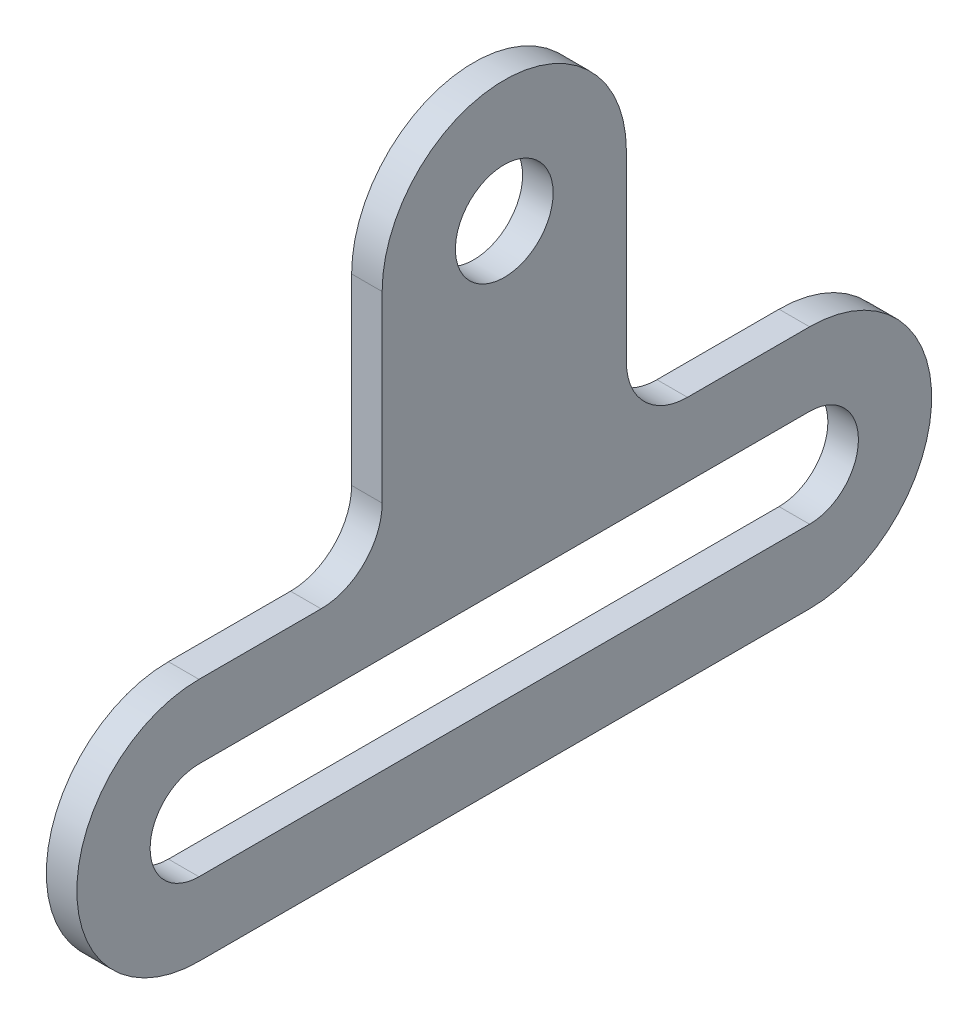
ISO-10303-21;
HEADER;
FILE_DESCRIPTION(('STEP AP214'),'2;1');
FILE_NAME('part.step','',(''),(''),'','','');
FILE_SCHEMA(('AUTOMOTIVE_DESIGN { 1 0 10303 214 1 1 1 1 }'));
ENDSEC;
DATA;
#1=APPLICATION_CONTEXT('core data for automotive mechanical design processes');
#2=APPLICATION_PROTOCOL_DEFINITION('international standard','automotive_design',2000,#1);
#3=PRODUCT_CONTEXT('',#1,'mechanical');
#4=PRODUCT('Part','Part','',(#3));
#5=PRODUCT_RELATED_PRODUCT_CATEGORY('part','',(#4));
#6=PRODUCT_DEFINITION_FORMATION('','',#4);
#7=PRODUCT_DEFINITION_CONTEXT('part definition',#1,'design');
#8=PRODUCT_DEFINITION('design','',#6,#7);
#9=PRODUCT_DEFINITION_SHAPE('','',#8);
#10=(LENGTH_UNIT() NAMED_UNIT(*) SI_UNIT(.MILLI.,.METRE.));
#11=(NAMED_UNIT(*) PLANE_ANGLE_UNIT() SI_UNIT($,.RADIAN.));
#12=(NAMED_UNIT(*) SI_UNIT($,.STERADIAN.) SOLID_ANGLE_UNIT());
#13=UNCERTAINTY_MEASURE_WITH_UNIT(LENGTH_MEASURE(1.E-05),#10,'distance_accuracy_value','');
#14=(GEOMETRIC_REPRESENTATION_CONTEXT(3) GLOBAL_UNCERTAINTY_ASSIGNED_CONTEXT((#13)) GLOBAL_UNIT_ASSIGNED_CONTEXT((#10,
#11,#12)) REPRESENTATION_CONTEXT('',''));
#15=CARTESIAN_POINT('',(0.,0.,0.));
#16=DIRECTION('',(0.,0.,1.));
#17=DIRECTION('',(1.,0.,0.));
#18=AXIS2_PLACEMENT_3D('',#15,#16,#17);
#19=CARTESIAN_POINT('',(0.5,0.,10.));
#20=DIRECTION('',(1.,0.,0.));
#21=DIRECTION('',(0.,0.,-1.));
#22=AXIS2_PLACEMENT_3D('',#19,#20,#21);
#23=PLANE('',#22);
#24=CARTESIAN_POINT('',(0.5,0.,10.));
#25=DIRECTION('',(1.,0.,0.));
#26=DIRECTION('',(0.,0.,-1.));
#27=AXIS2_PLACEMENT_3D('',#24,#25,#26);
#28=CIRCLE('',#27,4.);
#29=CARTESIAN_POINT('',(0.5,4.,10.));
#30=VERTEX_POINT('',#29);
#31=CARTESIAN_POINT('',(0.5,-4.,10.));
#32=VERTEX_POINT('',#31);
#33=EDGE_CURVE('E182',#30,#32,#28,.T.);
#34=ORIENTED_EDGE('',*,*,#33,.T.);
#35=DIRECTION('',(0.,0.,-1.));
#36=VECTOR('',#35,1.);
#37=CARTESIAN_POINT('',(0.5,-4.,10.));
#38=LINE('',#37,#36);
#39=CARTESIAN_POINT('',(0.5,-4.,-10.));
#40=VERTEX_POINT('',#39);
#41=EDGE_CURVE('E185',#32,#40,#38,.T.);
#42=ORIENTED_EDGE('',*,*,#41,.T.);
#43=CARTESIAN_POINT('',(0.5,0.,-10.));
#44=DIRECTION('',(1.,0.,0.));
#45=DIRECTION('',(0.,0.,-1.));
#46=AXIS2_PLACEMENT_3D('',#43,#44,#45);
#47=CIRCLE('',#46,4.);
#48=CARTESIAN_POINT('',(0.5,4.,-10.));
#49=VERTEX_POINT('',#48);
#50=EDGE_CURVE('E188',#40,#49,#47,.T.);
#51=ORIENTED_EDGE('',*,*,#50,.T.);
#52=DIRECTION('',(0.,0.,1.));
#53=VECTOR('',#52,1.);
#54=CARTESIAN_POINT('',(0.5,4.,-6.00000000000002));
#55=LINE('',#54,#53);
#56=CARTESIAN_POINT('',(0.5,4.,-6.00000000000002));
#57=VERTEX_POINT('',#56);
#58=EDGE_CURVE('E190',#49,#57,#55,.T.);
#59=ORIENTED_EDGE('',*,*,#58,.T.);
#60=CARTESIAN_POINT('',(0.5,6.,-6.));
#61=DIRECTION('',(-1.,0.,0.));
#62=DIRECTION('',(0.,0.,-1.));
#63=AXIS2_PLACEMENT_3D('',#60,#61,#62);
#64=CIRCLE('',#63,2.);
#65=CARTESIAN_POINT('',(0.5,6.00000000000001,-4.));
#66=VERTEX_POINT('',#65);
#67=EDGE_CURVE('E192',#57,#66,#64,.T.);
#68=ORIENTED_EDGE('',*,*,#67,.T.);
#69=DIRECTION('',(0.,1.,0.));
#70=VECTOR('',#69,1.);
#71=CARTESIAN_POINT('',(0.5,6.00000000000001,-4.));
#72=LINE('',#71,#70);
#73=CARTESIAN_POINT('',(0.5,12.,-4.));
#74=VERTEX_POINT('',#73);
#75=EDGE_CURVE('E194',#66,#74,#72,.T.);
#76=ORIENTED_EDGE('',*,*,#75,.T.);
#77=CARTESIAN_POINT('',(0.5,12.,0.));
#78=DIRECTION('',(1.,0.,0.));
#79=DIRECTION('',(0.,0.,-1.));
#80=AXIS2_PLACEMENT_3D('',#77,#78,#79);
#81=CIRCLE('',#80,4.);
#82=CARTESIAN_POINT('',(0.5,12.,4.));
#83=VERTEX_POINT('',#82);
#84=EDGE_CURVE('E196',#74,#83,#81,.T.);
#85=ORIENTED_EDGE('',*,*,#84,.T.);
#86=DIRECTION('',(0.,-1.,0.));
#87=VECTOR('',#86,1.);
#88=CARTESIAN_POINT('',(0.5,6.00000000000001,4.));
#89=LINE('',#88,#87);
#90=CARTESIAN_POINT('',(0.5,6.00000000000001,4.));
#91=VERTEX_POINT('',#90);
#92=EDGE_CURVE('E198',#83,#91,#89,.T.);
#93=ORIENTED_EDGE('',*,*,#92,.T.);
#94=CARTESIAN_POINT('',(0.5,6.,6.));
#95=DIRECTION('',(-1.,0.,0.));
#96=DIRECTION('',(0.,0.,1.));
#97=AXIS2_PLACEMENT_3D('',#94,#95,#96);
#98=CIRCLE('',#97,2.);
#99=CARTESIAN_POINT('',(0.5,4.,6.00000000000001));
#100=VERTEX_POINT('',#99);
#101=EDGE_CURVE('E200',#91,#100,#98,.T.);
#102=ORIENTED_EDGE('',*,*,#101,.T.);
#103=DIRECTION('',(0.,0.,1.));
#104=VECTOR('',#103,1.);
#105=CARTESIAN_POINT('',(0.5,4.,10.));
#106=LINE('',#105,#104);
#107=EDGE_CURVE('E202',#100,#30,#106,.T.);
#108=ORIENTED_EDGE('',*,*,#107,.T.);
#109=EDGE_LOOP('',(#34,#42,#51,#59,#68,#76,#85,#93,#102,#108));
#110=FACE_BOUND('',#109,.T.);
#111=CARTESIAN_POINT('',(0.5,12.,0.));
#112=DIRECTION('',(1.,0.,0.));
#113=DIRECTION('',(0.,0.,-1.));
#114=AXIS2_PLACEMENT_3D('',#111,#112,#113);
#115=CIRCLE('',#114,1.6);
#116=CARTESIAN_POINT('',(0.5,12.,-1.6));
#117=VERTEX_POINT('',#116);
#118=EDGE_CURVE('E176',#117,#117,#115,.T.);
#119=ORIENTED_EDGE('',*,*,#118,.F.);
#120=EDGE_LOOP('',(#119));
#121=FACE_BOUND('',#120,.T.);
#122=DIRECTION('',(0.,0.,-1.));
#123=VECTOR('',#122,1.);
#124=CARTESIAN_POINT('',(0.5,-1.6,10.));
#125=LINE('',#124,#123);
#126=CARTESIAN_POINT('',(0.5,-1.6,10.));
#127=VERTEX_POINT('',#126);
#128=CARTESIAN_POINT('',(0.5,-1.6,-10.));
#129=VERTEX_POINT('',#128);
#130=EDGE_CURVE('E148',#127,#129,#125,.T.);
#131=ORIENTED_EDGE('',*,*,#130,.F.);
#132=CARTESIAN_POINT('',(0.5,0.,10.));
#133=DIRECTION('',(1.,0.,0.));
#134=DIRECTION('',(0.,0.,-1.));
#135=AXIS2_PLACEMENT_3D('',#132,#133,#134);
#136=CIRCLE('',#135,1.6);
#137=CARTESIAN_POINT('',(0.5,1.6,10.));
#138=VERTEX_POINT('',#137);
#139=EDGE_CURVE('E140',#138,#127,#136,.T.);
#140=ORIENTED_EDGE('',*,*,#139,.F.);
#141=DIRECTION('',(0.,0.,1.));
#142=VECTOR('',#141,1.);
#143=CARTESIAN_POINT('',(0.5,1.6,10.));
#144=LINE('',#143,#142);
#145=CARTESIAN_POINT('',(0.5,1.6,-10.));
#146=VERTEX_POINT('',#145);
#147=EDGE_CURVE('E162',#146,#138,#144,.T.);
#148=ORIENTED_EDGE('',*,*,#147,.F.);
#149=CARTESIAN_POINT('',(0.5,0.,-10.));
#150=DIRECTION('',(1.,0.,0.));
#151=DIRECTION('',(0.,0.,-1.));
#152=AXIS2_PLACEMENT_3D('',#149,#150,#151);
#153=CIRCLE('',#152,1.6);
#154=EDGE_CURVE('E160',#129,#146,#153,.T.);
#155=ORIENTED_EDGE('',*,*,#154,.F.);
#156=EDGE_LOOP('',(#131,#140,#148,#155));
#157=FACE_BOUND('',#156,.T.);
#158=ADVANCED_FACE('F39',(#110,#121,#157),#23,.T.);
#159=CARTESIAN_POINT('',(-0.5,0.,10.));
#160=DIRECTION('',(1.,0.,0.));
#161=DIRECTION('',(0.,0.,-1.));
#162=AXIS2_PLACEMENT_3D('',#159,#160,#161);
#163=PLANE('',#162);
#164=CARTESIAN_POINT('',(-0.5,12.,0.));
#165=DIRECTION('',(1.,0.,0.));
#166=DIRECTION('',(0.,0.,-1.));
#167=AXIS2_PLACEMENT_3D('',#164,#165,#166);
#168=CIRCLE('',#167,1.6);
#169=CARTESIAN_POINT('',(-0.5,12.,-1.6));
#170=VERTEX_POINT('',#169);
#171=EDGE_CURVE('E156',#170,#170,#168,.T.);
#172=ORIENTED_EDGE('',*,*,#171,.T.);
#173=EDGE_LOOP('',(#172));
#174=FACE_BOUND('',#173,.T.);
#175=CARTESIAN_POINT('',(-0.5,0.,10.));
#176=DIRECTION('',(1.,0.,0.));
#177=DIRECTION('',(0.,0.,-1.));
#178=AXIS2_PLACEMENT_3D('',#175,#176,#177);
#179=CIRCLE('',#178,4.);
#180=CARTESIAN_POINT('',(-0.5,4.,10.));
#181=VERTEX_POINT('',#180);
#182=CARTESIAN_POINT('',(-0.5,-4.,10.));
#183=VERTEX_POINT('',#182);
#184=EDGE_CURVE('E179',#181,#183,#179,.T.);
#185=ORIENTED_EDGE('',*,*,#184,.F.);
#186=DIRECTION('',(0.,0.,1.));
#187=VECTOR('',#186,1.);
#188=CARTESIAN_POINT('',(-0.5,4.,10.));
#189=LINE('',#188,#187);
#190=CARTESIAN_POINT('',(-0.5,4.,6.00000000000001));
#191=VERTEX_POINT('',#190);
#192=EDGE_CURVE('E186',#191,#181,#189,.T.);
#193=ORIENTED_EDGE('',*,*,#192,.F.);
#194=CARTESIAN_POINT('',(-0.5,6.,6.));
#195=DIRECTION('',(-1.,0.,0.));
#196=DIRECTION('',(0.,0.,1.));
#197=AXIS2_PLACEMENT_3D('',#194,#195,#196);
#198=CIRCLE('',#197,2.);
#199=CARTESIAN_POINT('',(-0.5,6.00000000000001,4.));
#200=VERTEX_POINT('',#199);
#201=EDGE_CURVE('E221',#200,#191,#198,.T.);
#202=ORIENTED_EDGE('',*,*,#201,.F.);
#203=DIRECTION('',(0.,-1.,0.));
#204=VECTOR('',#203,1.);
#205=CARTESIAN_POINT('',(-0.5,6.00000000000001,4.));
#206=LINE('',#205,#204);
#207=CARTESIAN_POINT('',(-0.5,12.,4.));
#208=VERTEX_POINT('',#207);
#209=EDGE_CURVE('E219',#208,#200,#206,.T.);
#210=ORIENTED_EDGE('',*,*,#209,.F.);
#211=CARTESIAN_POINT('',(-0.5,12.,0.));
#212=DIRECTION('',(1.,0.,0.));
#213=DIRECTION('',(0.,0.,-1.));
#214=AXIS2_PLACEMENT_3D('',#211,#212,#213);
#215=CIRCLE('',#214,4.);
#216=CARTESIAN_POINT('',(-0.5,12.,-4.));
#217=VERTEX_POINT('',#216);
#218=EDGE_CURVE('E217',#217,#208,#215,.T.);
#219=ORIENTED_EDGE('',*,*,#218,.F.);
#220=DIRECTION('',(0.,1.,0.));
#221=VECTOR('',#220,1.);
#222=CARTESIAN_POINT('',(-0.5,6.00000000000001,-4.));
#223=LINE('',#222,#221);
#224=CARTESIAN_POINT('',(-0.5,6.00000000000001,-4.));
#225=VERTEX_POINT('',#224);
#226=EDGE_CURVE('E215',#225,#217,#223,.T.);
#227=ORIENTED_EDGE('',*,*,#226,.F.);
#228=CARTESIAN_POINT('',(-0.5,6.,-6.));
#229=DIRECTION('',(-1.,0.,0.));
#230=DIRECTION('',(0.,0.,-1.));
#231=AXIS2_PLACEMENT_3D('',#228,#229,#230);
#232=CIRCLE('',#231,2.);
#233=CARTESIAN_POINT('',(-0.5,4.,-6.00000000000002));
#234=VERTEX_POINT('',#233);
#235=EDGE_CURVE('E213',#234,#225,#232,.T.);
#236=ORIENTED_EDGE('',*,*,#235,.F.);
#237=DIRECTION('',(0.,0.,1.));
#238=VECTOR('',#237,1.);
#239=CARTESIAN_POINT('',(-0.5,4.,-6.00000000000002));
#240=LINE('',#239,#238);
#241=CARTESIAN_POINT('',(-0.5,4.,-10.));
#242=VERTEX_POINT('',#241);
#243=EDGE_CURVE('E211',#242,#234,#240,.T.);
#244=ORIENTED_EDGE('',*,*,#243,.F.);
#245=CARTESIAN_POINT('',(-0.5,0.,-10.));
#246=DIRECTION('',(1.,0.,0.));
#247=DIRECTION('',(0.,0.,-1.));
#248=AXIS2_PLACEMENT_3D('',#245,#246,#247);
#249=CIRCLE('',#248,4.);
#250=CARTESIAN_POINT('',(-0.5,-4.,-10.));
#251=VERTEX_POINT('',#250);
#252=EDGE_CURVE('E209',#251,#242,#249,.T.);
#253=ORIENTED_EDGE('',*,*,#252,.F.);
#254=DIRECTION('',(0.,0.,-1.));
#255=VECTOR('',#254,1.);
#256=CARTESIAN_POINT('',(-0.5,-4.,10.));
#257=LINE('',#256,#255);
#258=EDGE_CURVE('E207',#183,#251,#257,.T.);
#259=ORIENTED_EDGE('',*,*,#258,.F.);
#260=EDGE_LOOP('',(#185,#193,#202,#210,#219,#227,#236,#244,#253,#259));
#261=FACE_BOUND('',#260,.T.);
#262=CARTESIAN_POINT('',(-0.5,0.,10.));
#263=DIRECTION('',(1.,0.,0.));
#264=DIRECTION('',(0.,0.,-1.));
#265=AXIS2_PLACEMENT_3D('',#262,#263,#264);
#266=CIRCLE('',#265,1.6);
#267=CARTESIAN_POINT('',(-0.5,1.6,10.));
#268=VERTEX_POINT('',#267);
#269=CARTESIAN_POINT('',(-0.5,-1.6,10.));
#270=VERTEX_POINT('',#269);
#271=EDGE_CURVE('E62',#268,#270,#266,.T.);
#272=ORIENTED_EDGE('',*,*,#271,.T.);
#273=DIRECTION('',(0.,0.,-1.));
#274=VECTOR('',#273,1.);
#275=CARTESIAN_POINT('',(-0.5,-1.6,10.));
#276=LINE('',#275,#274);
#277=CARTESIAN_POINT('',(-0.5,-1.6,-10.));
#278=VERTEX_POINT('',#277);
#279=EDGE_CURVE('E155',#270,#278,#276,.T.);
#280=ORIENTED_EDGE('',*,*,#279,.T.);
#281=CARTESIAN_POINT('',(-0.5,0.,-10.));
#282=DIRECTION('',(1.,0.,0.));
#283=DIRECTION('',(0.,0.,-1.));
#284=AXIS2_PLACEMENT_3D('',#281,#282,#283);
#285=CIRCLE('',#284,1.6);
#286=CARTESIAN_POINT('',(-0.5,1.6,-10.));
#287=VERTEX_POINT('',#286);
#288=EDGE_CURVE('E168',#278,#287,#285,.T.);
#289=ORIENTED_EDGE('',*,*,#288,.T.);
#290=DIRECTION('',(0.,0.,1.));
#291=VECTOR('',#290,1.);
#292=CARTESIAN_POINT('',(-0.5,1.6,10.));
#293=LINE('',#292,#291);
#294=EDGE_CURVE('E149',#287,#268,#293,.T.);
#295=ORIENTED_EDGE('',*,*,#294,.T.);
#296=EDGE_LOOP('',(#272,#280,#289,#295));
#297=FACE_BOUND('',#296,.T.);
#298=ADVANCED_FACE('F257',(#174,#261,#297),#163,.F.);
#299=CARTESIAN_POINT('',(0.5,0.,10.));
#300=DIRECTION('',(-1.,0.,0.));
#301=DIRECTION('',(0.,0.,1.));
#302=AXIS2_PLACEMENT_3D('',#299,#300,#301);
#303=CYLINDRICAL_SURFACE('',#302,4.);
#304=ORIENTED_EDGE('',*,*,#184,.T.);
#305=DIRECTION('',(-1.,0.,0.));
#306=VECTOR('',#305,1.);
#307=CARTESIAN_POINT('',(0.5,-4.,10.));
#308=LINE('',#307,#306);
#309=EDGE_CURVE('E11',#32,#183,#308,.T.);
#310=ORIENTED_EDGE('',*,*,#309,.F.);
#311=ORIENTED_EDGE('',*,*,#33,.F.);
#312=DIRECTION('',(-1.,0.,0.));
#313=VECTOR('',#312,1.);
#314=CARTESIAN_POINT('',(0.5,4.,10.));
#315=LINE('',#314,#313);
#316=EDGE_CURVE('E204',#30,#181,#315,.T.);
#317=ORIENTED_EDGE('',*,*,#316,.T.);
#318=EDGE_LOOP('',(#304,#310,#311,#317));
#319=FACE_BOUND('',#318,.T.);
#320=ADVANCED_FACE('F41',(#319),#303,.T.);
#321=CARTESIAN_POINT('',(0.5,-4.,10.));
#322=DIRECTION('',(0.,1.,0.));
#323=DIRECTION('',(0.,0.,1.));
#324=AXIS2_PLACEMENT_3D('',#321,#322,#323);
#325=PLANE('',#324);
#326=ORIENTED_EDGE('',*,*,#258,.T.);
#327=DIRECTION('',(-1.,0.,0.));
#328=VECTOR('',#327,1.);
#329=CARTESIAN_POINT('',(0.5,-4.,-10.));
#330=LINE('',#329,#328);
#331=EDGE_CURVE('E47',#40,#251,#330,.T.);
#332=ORIENTED_EDGE('',*,*,#331,.F.);
#333=ORIENTED_EDGE('',*,*,#41,.F.);
#334=ORIENTED_EDGE('',*,*,#309,.T.);
#335=EDGE_LOOP('',(#326,#332,#333,#334));
#336=FACE_BOUND('',#335,.T.);
#337=ADVANCED_FACE('F275',(#336),#325,.F.);
#338=CARTESIAN_POINT('',(0.5,0.,-10.));
#339=DIRECTION('',(-1.,0.,0.));
#340=DIRECTION('',(0.,0.,1.));
#341=AXIS2_PLACEMENT_3D('',#338,#339,#340);
#342=CYLINDRICAL_SURFACE('',#341,4.);
#343=ORIENTED_EDGE('',*,*,#252,.T.);
#344=DIRECTION('',(-1.,0.,0.));
#345=VECTOR('',#344,1.);
#346=CARTESIAN_POINT('',(0.5,4.,-10.));
#347=LINE('',#346,#345);
#348=EDGE_CURVE('E244',#49,#242,#347,.T.);
#349=ORIENTED_EDGE('',*,*,#348,.F.);
#350=ORIENTED_EDGE('',*,*,#50,.F.);
#351=ORIENTED_EDGE('',*,*,#331,.T.);
#352=EDGE_LOOP('',(#343,#349,#350,#351));
#353=FACE_BOUND('',#352,.T.);
#354=ADVANCED_FACE('F251',(#353),#342,.T.);
#355=CARTESIAN_POINT('',(0.5,4.,-6.00000000000002));
#356=DIRECTION('',(0.,-1.,0.));
#357=DIRECTION('',(0.,0.,-1.));
#358=AXIS2_PLACEMENT_3D('',#355,#356,#357);
#359=PLANE('',#358);
#360=ORIENTED_EDGE('',*,*,#243,.T.);
#361=DIRECTION('',(-1.,0.,0.));
#362=VECTOR('',#361,1.);
#363=CARTESIAN_POINT('',(0.5,4.,-6.00000000000002));
#364=LINE('',#363,#362);
#365=EDGE_CURVE('E241',#57,#234,#364,.T.);
#366=ORIENTED_EDGE('',*,*,#365,.F.);
#367=ORIENTED_EDGE('',*,*,#58,.F.);
#368=ORIENTED_EDGE('',*,*,#348,.T.);
#369=EDGE_LOOP('',(#360,#366,#367,#368));
#370=FACE_BOUND('',#369,.T.);
#371=ADVANCED_FACE('F263',(#370),#359,.F.);
#372=CARTESIAN_POINT('',(0.5,6.,-6.));
#373=DIRECTION('',(-1.,0.,0.));
#374=DIRECTION('',(0.,0.,1.));
#375=AXIS2_PLACEMENT_3D('',#372,#373,#374);
#376=CYLINDRICAL_SURFACE('',#375,2.);
#377=ORIENTED_EDGE('',*,*,#235,.T.);
#378=DIRECTION('',(-1.,0.,0.));
#379=VECTOR('',#378,1.);
#380=CARTESIAN_POINT('',(0.5,6.00000000000001,-4.));
#381=LINE('',#380,#379);
#382=EDGE_CURVE('E238',#66,#225,#381,.T.);
#383=ORIENTED_EDGE('',*,*,#382,.F.);
#384=ORIENTED_EDGE('',*,*,#67,.F.);
#385=ORIENTED_EDGE('',*,*,#365,.T.);
#386=EDGE_LOOP('',(#377,#383,#384,#385));
#387=FACE_BOUND('',#386,.T.);
#388=ADVANCED_FACE('F267',(#387),#376,.F.);
#389=CARTESIAN_POINT('',(0.5,6.00000000000001,-4.));
#390=DIRECTION('',(0.,0.,1.));
#391=DIRECTION('',(1.,0.,0.));
#392=AXIS2_PLACEMENT_3D('',#389,#390,#391);
#393=PLANE('',#392);
#394=ORIENTED_EDGE('',*,*,#226,.T.);
#395=DIRECTION('',(-1.,0.,0.));
#396=VECTOR('',#395,1.);
#397=CARTESIAN_POINT('',(0.5,12.,-4.));
#398=LINE('',#397,#396);
#399=EDGE_CURVE('E235',#74,#217,#398,.T.);
#400=ORIENTED_EDGE('',*,*,#399,.F.);
#401=ORIENTED_EDGE('',*,*,#75,.F.);
#402=ORIENTED_EDGE('',*,*,#382,.T.);
#403=EDGE_LOOP('',(#394,#400,#401,#402));
#404=FACE_BOUND('',#403,.T.);
#405=ADVANCED_FACE('F298',(#404),#393,.F.);
#406=CARTESIAN_POINT('',(0.5,12.,0.));
#407=DIRECTION('',(-1.,0.,0.));
#408=DIRECTION('',(0.,0.,1.));
#409=AXIS2_PLACEMENT_3D('',#406,#407,#408);
#410=CYLINDRICAL_SURFACE('',#409,4.);
#411=ORIENTED_EDGE('',*,*,#218,.T.);
#412=DIRECTION('',(-1.,0.,0.));
#413=VECTOR('',#412,1.);
#414=CARTESIAN_POINT('',(0.5,12.,4.));
#415=LINE('',#414,#413);
#416=EDGE_CURVE('E232',#83,#208,#415,.T.);
#417=ORIENTED_EDGE('',*,*,#416,.F.);
#418=ORIENTED_EDGE('',*,*,#84,.F.);
#419=ORIENTED_EDGE('',*,*,#399,.T.);
#420=EDGE_LOOP('',(#411,#417,#418,#419));
#421=FACE_BOUND('',#420,.T.);
#422=ADVANCED_FACE('F295',(#421),#410,.T.);
#423=CARTESIAN_POINT('',(0.5,6.00000000000001,4.));
#424=DIRECTION('',(0.,0.,-1.));
#425=DIRECTION('',(-1.,0.,0.));
#426=AXIS2_PLACEMENT_3D('',#423,#424,#425);
#427=PLANE('',#426);
#428=ORIENTED_EDGE('',*,*,#209,.T.);
#429=DIRECTION('',(-1.,0.,0.));
#430=VECTOR('',#429,1.);
#431=CARTESIAN_POINT('',(0.5,6.00000000000001,4.));
#432=LINE('',#431,#430);
#433=EDGE_CURVE('E229',#91,#200,#432,.T.);
#434=ORIENTED_EDGE('',*,*,#433,.F.);
#435=ORIENTED_EDGE('',*,*,#92,.F.);
#436=ORIENTED_EDGE('',*,*,#416,.T.);
#437=EDGE_LOOP('',(#428,#434,#435,#436));
#438=FACE_BOUND('',#437,.T.);
#439=ADVANCED_FACE('F291',(#438),#427,.F.);
#440=CARTESIAN_POINT('',(0.5,6.,6.));
#441=DIRECTION('',(-1.,0.,0.));
#442=DIRECTION('',(0.,0.,1.));
#443=AXIS2_PLACEMENT_3D('',#440,#441,#442);
#444=CYLINDRICAL_SURFACE('',#443,2.);
#445=ORIENTED_EDGE('',*,*,#201,.T.);
#446=DIRECTION('',(-1.,0.,0.));
#447=VECTOR('',#446,1.);
#448=CARTESIAN_POINT('',(0.5,4.,6.00000000000001));
#449=LINE('',#448,#447);
#450=EDGE_CURVE('E226',#100,#191,#449,.T.);
#451=ORIENTED_EDGE('',*,*,#450,.F.);
#452=ORIENTED_EDGE('',*,*,#101,.F.);
#453=ORIENTED_EDGE('',*,*,#433,.T.);
#454=EDGE_LOOP('',(#445,#451,#452,#453));
#455=FACE_BOUND('',#454,.T.);
#456=ADVANCED_FACE('F287',(#455),#444,.F.);
#457=CARTESIAN_POINT('',(0.5,4.,10.));
#458=DIRECTION('',(0.,-1.,0.));
#459=DIRECTION('',(0.,0.,-1.));
#460=AXIS2_PLACEMENT_3D('',#457,#458,#459);
#461=PLANE('',#460);
#462=ORIENTED_EDGE('',*,*,#192,.T.);
#463=ORIENTED_EDGE('',*,*,#316,.F.);
#464=ORIENTED_EDGE('',*,*,#107,.F.);
#465=ORIENTED_EDGE('',*,*,#450,.T.);
#466=EDGE_LOOP('',(#462,#463,#464,#465));
#467=FACE_BOUND('',#466,.T.);
#468=ADVANCED_FACE('F282',(#467),#461,.F.);
#469=CARTESIAN_POINT('',(0.5,12.,0.));
#470=DIRECTION('',(-1.,0.,0.));
#471=DIRECTION('',(0.,0.,1.));
#472=AXIS2_PLACEMENT_3D('',#469,#470,#471);
#473=CYLINDRICAL_SURFACE('',#472,1.6);
#474=ORIENTED_EDGE('',*,*,#118,.T.);
#475=EDGE_LOOP('',(#474));
#476=FACE_BOUND('',#475,.T.);
#477=ORIENTED_EDGE('',*,*,#171,.F.);
#478=EDGE_LOOP('',(#477));
#479=FACE_BOUND('',#478,.T.);
#480=ADVANCED_FACE('F315',(#476,#479),#473,.F.);
#481=CARTESIAN_POINT('',(0.5,0.,10.));
#482=DIRECTION('',(-1.,0.,0.));
#483=DIRECTION('',(0.,0.,1.));
#484=AXIS2_PLACEMENT_3D('',#481,#482,#483);
#485=CYLINDRICAL_SURFACE('',#484,1.6);
#486=ORIENTED_EDGE('',*,*,#271,.F.);
#487=DIRECTION('',(-1.,0.,0.));
#488=VECTOR('',#487,1.);
#489=CARTESIAN_POINT('',(0.5,1.6,10.));
#490=LINE('',#489,#488);
#491=EDGE_CURVE('E144',#138,#268,#490,.T.);
#492=ORIENTED_EDGE('',*,*,#491,.F.);
#493=ORIENTED_EDGE('',*,*,#139,.T.);
#494=DIRECTION('',(-1.,0.,0.));
#495=VECTOR('',#494,1.);
#496=CARTESIAN_POINT('',(0.5,-1.6,10.));
#497=LINE('',#496,#495);
#498=EDGE_CURVE('E143',#127,#270,#497,.T.);
#499=ORIENTED_EDGE('',*,*,#498,.T.);
#500=EDGE_LOOP('',(#486,#492,#493,#499));
#501=FACE_BOUND('',#500,.T.);
#502=ADVANCED_FACE('F142',(#501),#485,.F.);
#503=CARTESIAN_POINT('',(0.5,-1.6,10.));
#504=DIRECTION('',(0.,1.,0.));
#505=DIRECTION('',(0.,0.,1.));
#506=AXIS2_PLACEMENT_3D('',#503,#504,#505);
#507=PLANE('',#506);
#508=ORIENTED_EDGE('',*,*,#279,.F.);
#509=ORIENTED_EDGE('',*,*,#498,.F.);
#510=ORIENTED_EDGE('',*,*,#130,.T.);
#511=DIRECTION('',(-1.,0.,0.));
#512=VECTOR('',#511,1.);
#513=CARTESIAN_POINT('',(0.5,-1.6,-10.));
#514=LINE('',#513,#512);
#515=EDGE_CURVE('E157',#129,#278,#514,.T.);
#516=ORIENTED_EDGE('',*,*,#515,.T.);
#517=EDGE_LOOP('',(#508,#509,#510,#516));
#518=FACE_BOUND('',#517,.T.);
#519=ADVANCED_FACE('F152',(#518),#507,.T.);
#520=CARTESIAN_POINT('',(0.5,0.,-10.));
#521=DIRECTION('',(-1.,0.,0.));
#522=DIRECTION('',(0.,0.,1.));
#523=AXIS2_PLACEMENT_3D('',#520,#521,#522);
#524=CYLINDRICAL_SURFACE('',#523,1.6);
#525=ORIENTED_EDGE('',*,*,#288,.F.);
#526=ORIENTED_EDGE('',*,*,#515,.F.);
#527=ORIENTED_EDGE('',*,*,#154,.T.);
#528=DIRECTION('',(-1.,0.,0.));
#529=VECTOR('',#528,1.);
#530=CARTESIAN_POINT('',(0.5,1.6,-10.));
#531=LINE('',#530,#529);
#532=EDGE_CURVE('E54',#146,#287,#531,.T.);
#533=ORIENTED_EDGE('',*,*,#532,.T.);
#534=EDGE_LOOP('',(#525,#526,#527,#533));
#535=FACE_BOUND('',#534,.T.);
#536=ADVANCED_FACE('F352',(#535),#524,.F.);
#537=CARTESIAN_POINT('',(0.5,1.6,10.));
#538=DIRECTION('',(0.,-1.,0.));
#539=DIRECTION('',(0.,0.,-1.));
#540=AXIS2_PLACEMENT_3D('',#537,#538,#539);
#541=PLANE('',#540);
#542=ORIENTED_EDGE('',*,*,#294,.F.);
#543=ORIENTED_EDGE('',*,*,#532,.F.);
#544=ORIENTED_EDGE('',*,*,#147,.T.);
#545=ORIENTED_EDGE('',*,*,#491,.T.);
#546=EDGE_LOOP('',(#542,#543,#544,#545));
#547=FACE_BOUND('',#546,.T.);
#548=ADVANCED_FACE('F359',(#547),#541,.T.);
#549=CLOSED_SHELL('',(#158,#298,#320,#337,#354,#371,#388,#405,#422,#439,#456,#468,#480,#502,
#519,#536,#548));
#550=MANIFOLD_SOLID_BREP('B2',#549);
#551=ADVANCED_BREP_SHAPE_REPRESENTATION('',(#18,#550),#14);
#552=SHAPE_DEFINITION_REPRESENTATION(#9,#551);
ENDSEC;
END-ISO-10303-21;
